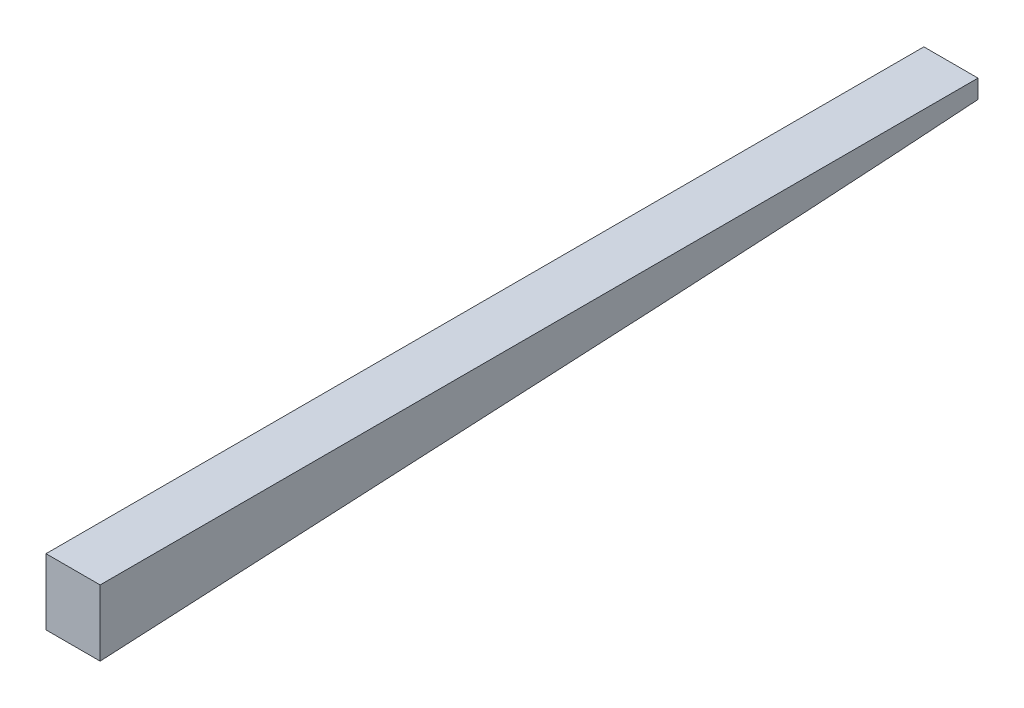
ISO-10303-21;
HEADER;
FILE_DESCRIPTION(('STEP AP214'),'2;1');
FILE_NAME('part.step','',(''),(''),'','','');
FILE_SCHEMA(('AUTOMOTIVE_DESIGN { 1 0 10303 214 1 1 1 1 }'));
ENDSEC;
DATA;
#1=APPLICATION_CONTEXT('core data for automotive mechanical design processes');
#2=APPLICATION_PROTOCOL_DEFINITION('international standard','automotive_design',2000,#1);
#3=PRODUCT_CONTEXT('',#1,'mechanical');
#4=PRODUCT('Part','Part','',(#3));
#5=PRODUCT_RELATED_PRODUCT_CATEGORY('part','',(#4));
#6=PRODUCT_DEFINITION_FORMATION('','',#4);
#7=PRODUCT_DEFINITION_CONTEXT('part definition',#1,'design');
#8=PRODUCT_DEFINITION('design','',#6,#7);
#9=PRODUCT_DEFINITION_SHAPE('','',#8);
#10=(LENGTH_UNIT() NAMED_UNIT(*) SI_UNIT(.MILLI.,.METRE.));
#11=(NAMED_UNIT(*) PLANE_ANGLE_UNIT() SI_UNIT($,.RADIAN.));
#12=(NAMED_UNIT(*) SI_UNIT($,.STERADIAN.) SOLID_ANGLE_UNIT());
#13=UNCERTAINTY_MEASURE_WITH_UNIT(LENGTH_MEASURE(1.E-05),#10,'distance_accuracy_value','');
#14=(GEOMETRIC_REPRESENTATION_CONTEXT(3) GLOBAL_UNCERTAINTY_ASSIGNED_CONTEXT((#13)) GLOBAL_UNIT_ASSIGNED_CONTEXT((#10,
#11,#12)) REPRESENTATION_CONTEXT('',''));
#15=CARTESIAN_POINT('',(0.,0.,0.));
#16=DIRECTION('',(0.,0.,1.));
#17=DIRECTION('',(1.,0.,0.));
#18=AXIS2_PLACEMENT_3D('',#15,#16,#17);
#19=CARTESIAN_POINT('',(0.,0.,-584.2));
#20=DIRECTION('',(0.,0.,1.));
#21=DIRECTION('',(1.,0.,0.));
#22=AXIS2_PLACEMENT_3D('',#19,#20,#21);
#23=PLANE('',#22);
#24=DIRECTION('',(0.,-1.,0.));
#25=VECTOR('',#24,1.);
#26=CARTESIAN_POINT('',(18.161,0.,-584.2));
#27=LINE('',#26,#25);
#28=CARTESIAN_POINT('',(18.161,5.96900000000002,-584.2));
#29=VERTEX_POINT('',#28);
#30=CARTESIAN_POINT('',(18.161,-38.3259162166958,-584.2));
#31=VERTEX_POINT('',#30);
#32=EDGE_CURVE('E141',#29,#31,#27,.T.);
#33=ORIENTED_EDGE('',*,*,#32,.F.);
#34=DIRECTION('',(1.,0.,0.));
#35=VECTOR('',#34,1.);
#36=CARTESIAN_POINT('',(0.,5.96900000000002,-584.2));
#37=LINE('',#36,#35);
#38=CARTESIAN_POINT('',(-18.161,5.96900000000002,-584.2));
#39=VERTEX_POINT('',#38);
#40=EDGE_CURVE('E120',#39,#29,#37,.T.);
#41=ORIENTED_EDGE('',*,*,#40,.F.);
#42=DIRECTION('',(0.,-1.,0.));
#43=VECTOR('',#42,1.);
#44=CARTESIAN_POINT('',(-18.161,0.,-584.2));
#45=LINE('',#44,#43);
#46=CARTESIAN_POINT('',(-18.161,-38.3259162166958,-584.2));
#47=VERTEX_POINT('',#46);
#48=EDGE_CURVE('E107',#39,#47,#45,.T.);
#49=ORIENTED_EDGE('',*,*,#48,.T.);
#50=DIRECTION('',(1.,0.,0.));
#51=VECTOR('',#50,1.);
#52=CARTESIAN_POINT('',(0.,-38.3259162166958,-584.2));
#53=LINE('',#52,#51);
#54=EDGE_CURVE('E115',#47,#31,#53,.T.);
#55=ORIENTED_EDGE('',*,*,#54,.T.);
#56=EDGE_LOOP('',(#33,#41,#49,#55));
#57=FACE_BOUND('',#56,.T.);
#58=ADVANCED_FACE('F45',(#57),#23,.T.);
#59=CARTESIAN_POINT('',(0.,5.96900000000002,0.));
#60=DIRECTION('',(0.,1.,0.));
#61=DIRECTION('',(0.,0.,1.));
#62=AXIS2_PLACEMENT_3D('',#59,#60,#61);
#63=PLANE('',#62);
#64=DIRECTION('',(0.,0.,1.));
#65=VECTOR('',#64,1.);
#66=CARTESIAN_POINT('',(-18.161,5.96900000000002,0.));
#67=LINE('',#66,#65);
#68=CARTESIAN_POINT('',(-18.161,5.96900000000002,-1173.17130026192));
#69=VERTEX_POINT('',#68);
#70=EDGE_CURVE('E54',#69,#39,#67,.T.);
#71=ORIENTED_EDGE('',*,*,#70,.T.);
#72=ORIENTED_EDGE('',*,*,#40,.T.);
#73=DIRECTION('',(0.,0.,1.));
#74=VECTOR('',#73,1.);
#75=CARTESIAN_POINT('',(18.161,5.96900000000002,0.));
#76=LINE('',#75,#74);
#77=CARTESIAN_POINT('',(18.161,5.96900000000002,-1173.17130026192));
#78=VERTEX_POINT('',#77);
#79=EDGE_CURVE('E129',#78,#29,#76,.T.);
#80=ORIENTED_EDGE('',*,*,#79,.F.);
#81=DIRECTION('',(-1.,0.,0.));
#82=VECTOR('',#81,1.);
#83=CARTESIAN_POINT('',(0.,5.96900000000002,-1173.17130026192));
#84=LINE('',#83,#82);
#85=EDGE_CURVE('E11',#78,#69,#84,.T.);
#86=ORIENTED_EDGE('',*,*,#85,.T.);
#87=EDGE_LOOP('',(#71,#72,#80,#86));
#88=FACE_BOUND('',#87,.T.);
#89=ADVANCED_FACE('F154',(#88),#63,.T.);
#90=CARTESIAN_POINT('',(0.,-67.7711940185204,-3.43606327571275));
#91=DIRECTION('',(0.,0.998717179985735,0.0506359003212277));
#92=DIRECTION('',(0.,-0.0506359003212277,0.998717179985735));
#93=AXIS2_PLACEMENT_3D('',#90,#91,#92);
#94=PLANE('',#93);
#95=ORIENTED_EDGE('',*,*,#54,.F.);
#96=DIRECTION('',(0.,0.0506359003212277,-0.998717179985735));
#97=VECTOR('',#96,1.);
#98=CARTESIAN_POINT('',(-18.161,-67.7711940185204,-3.43606327571275));
#99=LINE('',#98,#97);
#100=CARTESIAN_POINT('',(-18.161,-19.4085948962424,-957.315787063962));
#101=VERTEX_POINT('',#100);
#102=EDGE_CURVE('E103',#47,#101,#99,.T.);
#103=ORIENTED_EDGE('',*,*,#102,.T.);
#104=DIRECTION('',(-0.0316316011868878,-0.0506105618990205,0.99821741761533));
#105=VECTOR('',#104,1.);
#106=CARTESIAN_POINT('',(-48.3392098173077,-67.6937306039349,-4.96391293329035));
#107=LINE('',#106,#105);
#108=CARTESIAN_POINT('',(-11.320951542641,-8.46451736446796,-1173.17130026192));
#109=VERTEX_POINT('',#108);
#110=EDGE_CURVE('E140',#101,#109,#107,.F.);
#111=ORIENTED_EDGE('',*,*,#110,.T.);
#112=DIRECTION('',(1.,0.,0.));
#113=VECTOR('',#112,1.);
#114=CARTESIAN_POINT('',(0.,-8.46451736446795,-1173.17130026192));
#115=LINE('',#114,#113);
#116=CARTESIAN_POINT('',(11.320951542641,-8.46451736446796,-1173.17130026192));
#117=VERTEX_POINT('',#116);
#118=EDGE_CURVE('E145',#109,#117,#115,.T.);
#119=ORIENTED_EDGE('',*,*,#118,.T.);
#120=DIRECTION('',(0.0316316011868878,-0.0506105618990205,0.998217417615331));
#121=VECTOR('',#120,1.);
#122=CARTESIAN_POINT('',(48.3392098173078,-67.6937306039349,-4.96391293329035));
#123=LINE('',#122,#121);
#124=CARTESIAN_POINT('',(18.161,-19.4085948962425,-957.315787063961));
#125=VERTEX_POINT('',#124);
#126=EDGE_CURVE('E138',#117,#125,#123,.T.);
#127=ORIENTED_EDGE('',*,*,#126,.T.);
#128=DIRECTION('',(0.,0.0506359003212277,-0.998717179985735));
#129=VECTOR('',#128,1.);
#130=CARTESIAN_POINT('',(18.161,-67.7711940185204,-3.43606327571275));
#131=LINE('',#130,#129);
#132=EDGE_CURVE('E118',#31,#125,#131,.T.);
#133=ORIENTED_EDGE('',*,*,#132,.F.);
#134=EDGE_LOOP('',(#95,#103,#111,#119,#127,#133));
#135=FACE_BOUND('',#134,.T.);
#136=ADVANCED_FACE('F116',(#135),#94,.F.);
#137=CARTESIAN_POINT('',(18.161,0.,0.));
#138=DIRECTION('',(1.,0.,0.));
#139=DIRECTION('',(0.,0.,-1.));
#140=AXIS2_PLACEMENT_3D('',#137,#138,#139);
#141=PLANE('',#140);
#142=ORIENTED_EDGE('',*,*,#79,.T.);
#143=ORIENTED_EDGE('',*,*,#32,.T.);
#144=ORIENTED_EDGE('',*,*,#132,.T.);
#145=CARTESIAN_POINT('',(18.161,-6.72488671042363,-956.672711129881));
#146=DIRECTION('',(1.,0.,0.));
#147=DIRECTION('',(0.,-0.0506359003212277,0.998717179985735));
#148=AXIS2_PLACEMENT_3D('',#145,#146,#147);
#149=ELLIPSE('',#148,401.497221875208,12.7);
#150=CARTESIAN_POINT('',(18.161,-6.46272974411309,-1173.17130026192));
#151=VERTEX_POINT('',#150);
#152=EDGE_CURVE('E111',#151,#125,#149,.F.);
#153=ORIENTED_EDGE('',*,*,#152,.F.);
#154=DIRECTION('',(0.,1.,0.));
#155=VECTOR('',#154,1.);
#156=CARTESIAN_POINT('',(18.161,0.,-1173.17130026192));
#157=LINE('',#156,#155);
#158=EDGE_CURVE('E62',#151,#78,#157,.T.);
#159=ORIENTED_EDGE('',*,*,#158,.T.);
#160=EDGE_LOOP('',(#142,#143,#144,#153,#159));
#161=FACE_BOUND('',#160,.T.);
#162=ADVANCED_FACE('F47',(#161),#141,.T.);
#163=CARTESIAN_POINT('',(-18.161,0.,0.));
#164=DIRECTION('',(1.,0.,0.));
#165=DIRECTION('',(0.,0.,-1.));
#166=AXIS2_PLACEMENT_3D('',#163,#164,#165);
#167=PLANE('',#166);
#168=ORIENTED_EDGE('',*,*,#48,.F.);
#169=ORIENTED_EDGE('',*,*,#70,.F.);
#170=DIRECTION('',(0.,1.,0.));
#171=VECTOR('',#170,1.);
#172=CARTESIAN_POINT('',(-18.161,0.,-1173.17130026192));
#173=LINE('',#172,#171);
#174=CARTESIAN_POINT('',(-18.161,-6.46272974411311,-1173.17130026192));
#175=VERTEX_POINT('',#174);
#176=EDGE_CURVE('E70',#175,#69,#173,.T.);
#177=ORIENTED_EDGE('',*,*,#176,.F.);
#178=CARTESIAN_POINT('',(-18.161,-6.72488671042359,-956.672711129882));
#179=DIRECTION('',(1.,0.,0.));
#180=DIRECTION('',(0.,-0.0506359003212277,0.998717179985735));
#181=AXIS2_PLACEMENT_3D('',#178,#179,#180);
#182=ELLIPSE('',#181,401.497221875209,12.7);
#183=EDGE_CURVE('E108',#175,#101,#182,.F.);
#184=ORIENTED_EDGE('',*,*,#183,.T.);
#185=ORIENTED_EDGE('',*,*,#102,.F.);
#186=EDGE_LOOP('',(#168,#169,#177,#184,#185));
#187=FACE_BOUND('',#186,.T.);
#188=ADVANCED_FACE('F105',(#187),#167,.F.);
#189=CARTESIAN_POINT('',(-48.3392098173077,-55.010022418116,-4.32083699921076));
#190=DIRECTION('',(-0.0316316011868878,-0.0506105618990205,0.99821741761533));
#191=DIRECTION('',(0.,-0.998717179985735,-0.0506359003212277));
#192=AXIS2_PLACEMENT_3D('',#189,#190,#191);
#193=CYLINDRICAL_SURFACE('',#192,12.7);
#194=ORIENTED_EDGE('',*,*,#183,.F.);
#195=CARTESIAN_POINT('',(-11.3005736959707,4.25179537602321,-1173.17130026192));
#196=DIRECTION('',(0.,0.,1.));
#197=DIRECTION('',(-0.52999894000318,-0.847998304005088,0.));
#198=AXIS2_PLACEMENT_3D('',#195,#196,#197);
#199=ELLIPSE('',#198,12.7226792238703,12.7);
#200=EDGE_CURVE('E144',#109,#175,#199,.F.);
#201=ORIENTED_EDGE('',*,*,#200,.F.);
#202=ORIENTED_EDGE('',*,*,#110,.F.);
#203=EDGE_LOOP('',(#194,#201,#202));
#204=FACE_BOUND('',#203,.T.);
#205=ADVANCED_FACE('F163',(#204),#193,.T.);
#206=CARTESIAN_POINT('',(48.3392098173078,-55.010022418116,-4.32083699921076));
#207=DIRECTION('',(0.0316316011868878,-0.0506105618990205,0.998217417615331));
#208=DIRECTION('',(0.,-0.998717179985735,-0.0506359003212277));
#209=AXIS2_PLACEMENT_3D('',#206,#207,#208);
#210=CYLINDRICAL_SURFACE('',#209,12.7);
#211=CARTESIAN_POINT('',(11.3005736959707,4.2517953760232,-1173.17130026192));
#212=DIRECTION('',(0.,0.,1.));
#213=DIRECTION('',(0.52999894000318,-0.847998304005088,0.));
#214=AXIS2_PLACEMENT_3D('',#211,#212,#213);
#215=ELLIPSE('',#214,12.7226792238703,12.7);
#216=EDGE_CURVE('E142',#151,#117,#215,.F.);
#217=ORIENTED_EDGE('',*,*,#216,.F.);
#218=ORIENTED_EDGE('',*,*,#152,.T.);
#219=ORIENTED_EDGE('',*,*,#126,.F.);
#220=EDGE_LOOP('',(#217,#218,#219));
#221=FACE_BOUND('',#220,.T.);
#222=ADVANCED_FACE('F158',(#221),#210,.T.);
#223=CARTESIAN_POINT('',(0.,0.,-1173.17130026192));
#224=DIRECTION('',(0.,0.,1.));
#225=DIRECTION('',(1.,0.,0.));
#226=AXIS2_PLACEMENT_3D('',#223,#224,#225);
#227=PLANE('',#226);
#228=ORIENTED_EDGE('',*,*,#85,.F.);
#229=ORIENTED_EDGE('',*,*,#158,.F.);
#230=ORIENTED_EDGE('',*,*,#216,.T.);
#231=ORIENTED_EDGE('',*,*,#118,.F.);
#232=ORIENTED_EDGE('',*,*,#200,.T.);
#233=ORIENTED_EDGE('',*,*,#176,.T.);
#234=EDGE_LOOP('',(#228,#229,#230,#231,#232,#233));
#235=FACE_BOUND('',#234,.T.);
#236=ADVANCED_FACE('F161',(#235),#227,.F.);
#237=CLOSED_SHELL('',(#58,#89,#136,#162,#188,#205,#222,#236));
#238=MANIFOLD_SOLID_BREP('B2',#237);
#239=ADVANCED_BREP_SHAPE_REPRESENTATION('',(#18,#238),#14);
#240=SHAPE_DEFINITION_REPRESENTATION(#9,#239);
ENDSEC;
END-ISO-10303-21;
